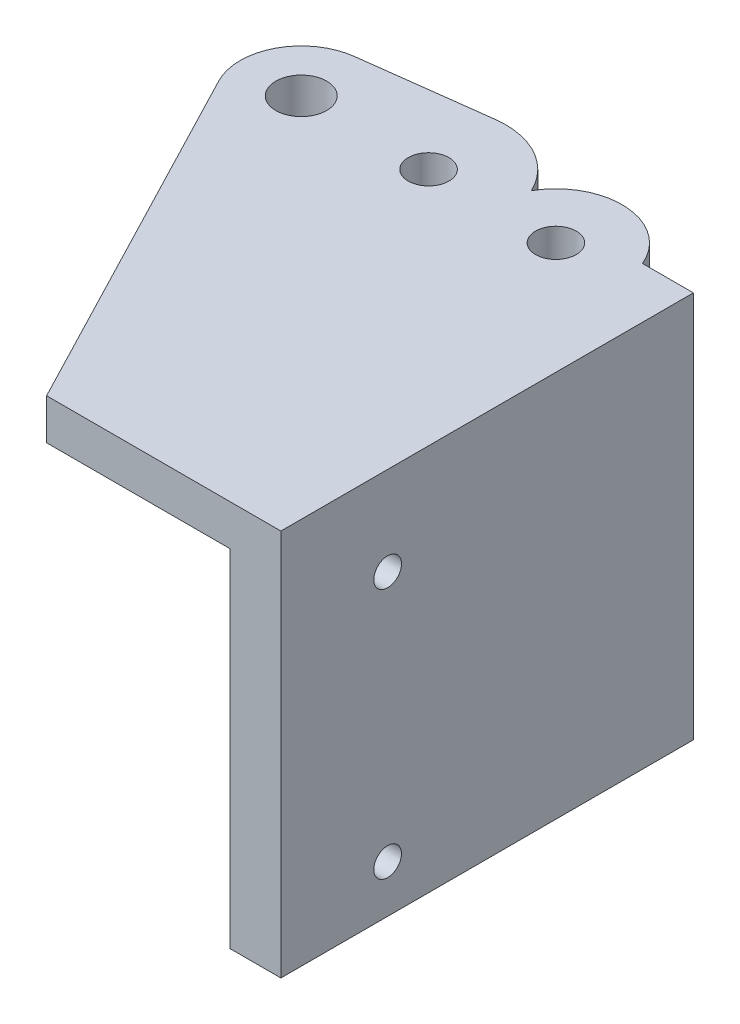
ISO-10303-21;
HEADER;
FILE_DESCRIPTION(('STEP AP214'),'2;1');
FILE_NAME('part.step','',(''),(''),'','','');
FILE_SCHEMA(('AUTOMOTIVE_DESIGN { 1 0 10303 214 1 1 1 1 }'));
ENDSEC;
DATA;
#1=APPLICATION_CONTEXT('core data for automotive mechanical design processes');
#2=APPLICATION_PROTOCOL_DEFINITION('international standard','automotive_design',2000,#1);
#3=PRODUCT_CONTEXT('',#1,'mechanical');
#4=PRODUCT('Part','Part','',(#3));
#5=PRODUCT_RELATED_PRODUCT_CATEGORY('part','',(#4));
#6=PRODUCT_DEFINITION_FORMATION('','',#4);
#7=PRODUCT_DEFINITION_CONTEXT('part definition',#1,'design');
#8=PRODUCT_DEFINITION('design','',#6,#7);
#9=PRODUCT_DEFINITION_SHAPE('','',#8);
#10=(LENGTH_UNIT() NAMED_UNIT(*) SI_UNIT(.MILLI.,.METRE.));
#11=(NAMED_UNIT(*) PLANE_ANGLE_UNIT() SI_UNIT($,.RADIAN.));
#12=(NAMED_UNIT(*) SI_UNIT($,.STERADIAN.) SOLID_ANGLE_UNIT());
#13=UNCERTAINTY_MEASURE_WITH_UNIT(LENGTH_MEASURE(1.E-05),#10,'distance_accuracy_value','');
#14=(GEOMETRIC_REPRESENTATION_CONTEXT(3) GLOBAL_UNCERTAINTY_ASSIGNED_CONTEXT((#13)) GLOBAL_UNIT_ASSIGNED_CONTEXT((#10,
#11,#12)) REPRESENTATION_CONTEXT('',''));
#15=CARTESIAN_POINT('',(0.,0.,0.));
#16=DIRECTION('',(0.,0.,1.));
#17=DIRECTION('',(1.,0.,0.));
#18=AXIS2_PLACEMENT_3D('',#15,#16,#17);
#19=CARTESIAN_POINT('',(0.,-3.175,0.));
#20=DIRECTION('',(0.,1.,0.));
#21=DIRECTION('',(0.,0.,1.));
#22=AXIS2_PLACEMENT_3D('',#19,#20,#21);
#23=PLANE('',#22);
#24=DIRECTION('',(0.,0.,-1.));
#25=VECTOR('',#24,1.);
#26=CARTESIAN_POINT('',(24.60625,-3.175,-7.9375));
#27=LINE('',#26,#25);
#28=CARTESIAN_POINT('',(24.60625,-3.175,30.1625));
#29=VERTEX_POINT('',#28);
#30=CARTESIAN_POINT('',(24.60625,-3.175,1.9813242485078));
#31=VERTEX_POINT('',#30);
#32=EDGE_CURVE('E566',#29,#31,#27,.T.);
#33=ORIENTED_EDGE('',*,*,#32,.F.);
#34=DIRECTION('',(1.,0.,0.));
#35=VECTOR('',#34,1.);
#36=CARTESIAN_POINT('',(28.575,-3.175,30.1625));
#37=LINE('',#36,#35);
#38=CARTESIAN_POINT('',(10.31875,-3.175,30.1625));
#39=VERTEX_POINT('',#38);
#40=EDGE_CURVE('E496',#39,#29,#37,.T.);
#41=ORIENTED_EDGE('',*,*,#40,.F.);
#42=DIRECTION('',(0.461406677584181,0.,0.887188749861453));
#43=VECTOR('',#42,1.);
#44=CARTESIAN_POINT('',(-4.22523642121517,-3.175,2.19744930199466));
#45=LINE('',#44,#43);
#46=CARTESIAN_POINT('',(-4.22523642121517,-3.175,2.19744930199467));
#47=VERTEX_POINT('',#46);
#48=EDGE_CURVE('E507',#47,#39,#45,.T.);
#49=ORIENTED_EDGE('',*,*,#48,.F.);
#50=CARTESIAN_POINT('',(0.,-3.175,0.));
#51=DIRECTION('',(0.,-1.,0.));
#52=DIRECTION('',(0.,0.,-1.));
#53=AXIS2_PLACEMENT_3D('',#50,#51,#52);
#54=CIRCLE('',#53,4.7625);
#55=CARTESIAN_POINT('',(4.27912458099054,-3.175,2.09057386149414));
#56=VERTEX_POINT('',#55);
#57=EDGE_CURVE('E502',#56,#47,#54,.T.);
#58=ORIENTED_EDGE('',*,*,#57,.F.);
#59=CARTESIAN_POINT('',(9.92124,-3.175,0.));
#60=DIRECTION('',(0.,-1.,0.));
#61=DIRECTION('',(0.,0.,-1.));
#62=AXIS2_PLACEMENT_3D('',#59,#60,#61);
#63=CIRCLE('',#62,6.01697311542829);
#64=CARTESIAN_POINT('',(15.3649052181966,-3.175,2.5632936749392));
#65=VERTEX_POINT('',#64);
#66=EDGE_CURVE('E583',#65,#56,#63,.T.);
#67=ORIENTED_EDGE('',*,*,#66,.F.);
#68=CARTESIAN_POINT('',(19.84248,-3.175,0.));
#69=DIRECTION('',(0.,1.,0.));
#70=DIRECTION('',(0.,0.,1.));
#71=AXIS2_PLACEMENT_3D('',#68,#69,#70);
#72=CIRCLE('',#71,5.159375);
#73=EDGE_CURVE('E531',#31,#65,#72,.F.);
#74=ORIENTED_EDGE('',*,*,#73,.F.);
#75=EDGE_LOOP('',(#33,#41,#49,#58,#67,#74));
#76=FACE_BOUND('',#75,.T.);
#77=ADVANCED_FACE('F360',(#76),#23,.F.);
#78=CARTESIAN_POINT('',(19.84248,-6.223,0.));
#79=DIRECTION('',(0.,-1.,0.));
#80=DIRECTION('',(0.,0.,-1.));
#81=AXIS2_PLACEMENT_3D('',#78,#79,#80);
#82=PLANE('',#81);
#83=CARTESIAN_POINT('',(19.84248,-6.223,0.));
#84=DIRECTION('',(0.,-1.,0.));
#85=DIRECTION('',(0.,0.,-1.));
#86=AXIS2_PLACEMENT_3D('',#83,#84,#85);
#87=CIRCLE('',#86,1.5875);
#88=CARTESIAN_POINT('',(19.84248,-6.223,-1.5875));
#89=VERTEX_POINT('',#88);
#90=EDGE_CURVE('E592',#89,#89,#87,.T.);
#91=ORIENTED_EDGE('',*,*,#90,.F.);
#92=EDGE_LOOP('',(#91));
#93=FACE_BOUND('',#92,.T.);
#94=CARTESIAN_POINT('',(19.84248,-6.223,0.));
#95=DIRECTION('',(0.,-1.,0.));
#96=DIRECTION('',(0.,0.,-1.));
#97=AXIS2_PLACEMENT_3D('',#94,#95,#96);
#98=CIRCLE('',#97,5.159375);
#99=CARTESIAN_POINT('',(15.3649052181966,-6.223,-2.5632936749392));
#100=VERTEX_POINT('',#99);
#101=CARTESIAN_POINT('',(24.60625,-6.22300000000001,-1.9813242485078));
#102=VERTEX_POINT('',#101);
#103=EDGE_CURVE('E596',#100,#102,#98,.T.);
#104=ORIENTED_EDGE('',*,*,#103,.T.);
#105=DIRECTION('',(0.,0.,1.));
#106=VECTOR('',#105,1.);
#107=CARTESIAN_POINT('',(24.60625,-6.223,0.));
#108=LINE('',#107,#106);
#109=CARTESIAN_POINT('',(24.60625,-6.223,1.98132424850781));
#110=VERTEX_POINT('',#109);
#111=EDGE_CURVE('E573',#102,#110,#108,.T.);
#112=ORIENTED_EDGE('',*,*,#111,.T.);
#113=CARTESIAN_POINT('',(15.3649052181966,-6.223,2.5632936749392));
#114=VERTEX_POINT('',#113);
#115=EDGE_CURVE('E595',#110,#114,#98,.T.);
#116=ORIENTED_EDGE('',*,*,#115,.T.);
#117=CARTESIAN_POINT('',(9.92124,-6.223,0.));
#118=DIRECTION('',(0.,-1.,0.));
#119=DIRECTION('',(0.,0.,-1.));
#120=AXIS2_PLACEMENT_3D('',#117,#118,#119);
#121=CIRCLE('',#120,6.01697311542829);
#122=EDGE_CURVE('E584',#114,#100,#121,.F.);
#123=ORIENTED_EDGE('',*,*,#122,.T.);
#124=EDGE_LOOP('',(#104,#112,#116,#123));
#125=FACE_BOUND('',#124,.T.);
#126=ADVANCED_FACE('F630',(#93,#125),#82,.T.);
#127=CARTESIAN_POINT('',(19.84248,-6.223,0.));
#128=DIRECTION('',(0.,1.,0.));
#129=DIRECTION('',(0.,0.,1.));
#130=AXIS2_PLACEMENT_3D('',#127,#128,#129);
#131=CYLINDRICAL_SURFACE('',#130,5.159375);
#132=DIRECTION('',(0.,1.,0.));
#133=VECTOR('',#132,1.);
#134=CARTESIAN_POINT('',(24.60625,-6.223,-1.98132424850781));
#135=LINE('',#134,#133);
#136=CARTESIAN_POINT('',(24.60625,0.,-1.9813242485078));
#137=VERTEX_POINT('',#136);
#138=EDGE_CURVE('E460',#102,#137,#135,.T.);
#139=ORIENTED_EDGE('',*,*,#138,.F.);
#140=ORIENTED_EDGE('',*,*,#103,.F.);
#141=DIRECTION('',(0.,1.,0.));
#142=VECTOR('',#141,1.);
#143=CARTESIAN_POINT('',(15.3649052181966,-9.144,-2.5632936749392));
#144=LINE('',#143,#142);
#145=CARTESIAN_POINT('',(15.3649052181966,0.,-2.5632936749392));
#146=VERTEX_POINT('',#145);
#147=EDGE_CURVE('E525',#146,#100,#144,.F.);
#148=ORIENTED_EDGE('',*,*,#147,.F.);
#149=CARTESIAN_POINT('',(19.84248,0.,0.));
#150=DIRECTION('',(0.,1.,0.));
#151=DIRECTION('',(0.,0.,1.));
#152=AXIS2_PLACEMENT_3D('',#149,#150,#151);
#153=CIRCLE('',#152,5.159375);
#154=EDGE_CURVE('E812',#137,#146,#153,.T.);
#155=ORIENTED_EDGE('',*,*,#154,.F.);
#156=EDGE_LOOP('',(#139,#140,#148,#155));
#157=FACE_BOUND('',#156,.T.);
#158=ADVANCED_FACE('F637',(#157),#131,.T.);
#159=DIRECTION('',(0.,1.,0.));
#160=VECTOR('',#159,1.);
#161=CARTESIAN_POINT('',(24.60625,-6.223,1.98132424850781));
#162=LINE('',#161,#160);
#163=EDGE_CURVE('E571',#31,#110,#162,.F.);
#164=ORIENTED_EDGE('',*,*,#163,.F.);
#165=ORIENTED_EDGE('',*,*,#73,.T.);
#166=DIRECTION('',(0.,1.,0.));
#167=VECTOR('',#166,1.);
#168=CARTESIAN_POINT('',(15.3649052181966,-9.144,2.5632936749392));
#169=LINE('',#168,#167);
#170=EDGE_CURVE('E521',#114,#65,#169,.T.);
#171=ORIENTED_EDGE('',*,*,#170,.F.);
#172=ORIENTED_EDGE('',*,*,#115,.F.);
#173=EDGE_LOOP('',(#164,#165,#171,#172));
#174=FACE_BOUND('',#173,.T.);
#175=ADVANCED_FACE('F643',(#174),#131,.T.);
#176=CARTESIAN_POINT('',(4.27912458099054,-3.175,-2.09057386149414));
#177=VERTEX_POINT('',#176);
#178=CARTESIAN_POINT('',(9.16043479726732,-3.175,-5.96867999772828));
#179=VERTEX_POINT('',#178);
#180=EDGE_CURVE('E580',#177,#179,#63,.T.);
#181=ORIENTED_EDGE('',*,*,#180,.F.);
#182=CARTESIAN_POINT('',(-0.602185635286236,-3.175,-4.72427546938733));
#183=VERTEX_POINT('',#182);
#184=EDGE_CURVE('E513',#183,#177,#54,.T.);
#185=ORIENTED_EDGE('',*,*,#184,.F.);
#186=DIRECTION('',(-0.99197385183986,0.,0.126443178012858));
#187=VECTOR('',#186,1.);
#188=CARTESIAN_POINT('',(-0.602185635286236,-3.175,-4.72427546938733));
#189=LINE('',#188,#187);
#190=EDGE_CURVE('E499',#179,#183,#189,.T.);
#191=ORIENTED_EDGE('',*,*,#190,.F.);
#192=EDGE_LOOP('',(#181,#185,#191));
#193=FACE_BOUND('',#192,.T.);
#194=ADVANCED_FACE('F632',(#193),#23,.F.);
#195=CARTESIAN_POINT('',(0.,-3.175,0.));
#196=DIRECTION('',(0.,1.,0.));
#197=DIRECTION('',(0.,0.,1.));
#198=AXIS2_PLACEMENT_3D('',#195,#196,#197);
#199=CYLINDRICAL_SURFACE('',#198,4.7625);
#200=ORIENTED_EDGE('',*,*,#184,.T.);
#201=DIRECTION('',(0.,1.,0.));
#202=VECTOR('',#201,1.);
#203=CARTESIAN_POINT('',(4.27912458099054,-9.144,-2.09057386149414));
#204=LINE('',#203,#202);
#205=CARTESIAN_POINT('',(4.27912458099054,-6.223,-2.09057386149415));
#206=VERTEX_POINT('',#205);
#207=EDGE_CURVE('E590',#177,#206,#204,.F.);
#208=ORIENTED_EDGE('',*,*,#207,.T.);
#209=CARTESIAN_POINT('',(0.,-6.223,0.));
#210=DIRECTION('',(0.,-1.,0.));
#211=DIRECTION('',(0.,0.,-1.));
#212=AXIS2_PLACEMENT_3D('',#209,#210,#211);
#213=CIRCLE('',#212,4.7625);
#214=CARTESIAN_POINT('',(4.27912458099054,-6.223,2.09057386149415));
#215=VERTEX_POINT('',#214);
#216=EDGE_CURVE('E602',#215,#206,#213,.T.);
#217=ORIENTED_EDGE('',*,*,#216,.F.);
#218=DIRECTION('',(0.,1.,0.));
#219=VECTOR('',#218,1.);
#220=CARTESIAN_POINT('',(4.27912458099054,-9.144,2.09057386149414));
#221=LINE('',#220,#219);
#222=EDGE_CURVE('E383',#215,#56,#221,.T.);
#223=ORIENTED_EDGE('',*,*,#222,.T.);
#224=ORIENTED_EDGE('',*,*,#57,.T.);
#225=DIRECTION('',(0.,1.,0.));
#226=VECTOR('',#225,1.);
#227=CARTESIAN_POINT('',(-4.22523642121517,-3.175,2.19744930199466));
#228=LINE('',#227,#226);
#229=CARTESIAN_POINT('',(-4.22523642121517,0.,2.19744930199466));
#230=VERTEX_POINT('',#229);
#231=EDGE_CURVE('E503',#47,#230,#228,.T.);
#232=ORIENTED_EDGE('',*,*,#231,.T.);
#233=CARTESIAN_POINT('',(0.,0.,0.));
#234=DIRECTION('',(0.,1.,0.));
#235=DIRECTION('',(0.,0.,1.));
#236=AXIS2_PLACEMENT_3D('',#233,#234,#235);
#237=CIRCLE('',#236,4.7625);
#238=CARTESIAN_POINT('',(-0.602185635286236,0.,-4.72427546938733));
#239=VERTEX_POINT('',#238);
#240=EDGE_CURVE('E486',#239,#230,#237,.T.);
#241=ORIENTED_EDGE('',*,*,#240,.F.);
#242=DIRECTION('',(0.,1.,0.));
#243=VECTOR('',#242,1.);
#244=CARTESIAN_POINT('',(-0.602185635286236,-3.175,-4.72427546938733));
#245=LINE('',#244,#243);
#246=EDGE_CURVE('E506',#183,#239,#245,.T.);
#247=ORIENTED_EDGE('',*,*,#246,.F.);
#248=EDGE_LOOP('',(#200,#208,#217,#223,#224,#232,#241,#247));
#249=FACE_BOUND('',#248,.T.);
#250=ADVANCED_FACE('F547',(#249),#199,.T.);
#251=CARTESIAN_POINT('',(0.,-6.223,0.));
#252=DIRECTION('',(0.,-1.,0.));
#253=DIRECTION('',(0.,0.,-1.));
#254=AXIS2_PLACEMENT_3D('',#251,#252,#253);
#255=PLANE('',#254);
#256=CARTESIAN_POINT('',(0.,-6.223,0.));
#257=DIRECTION('',(0.,-1.,0.));
#258=DIRECTION('',(0.,0.,-1.));
#259=AXIS2_PLACEMENT_3D('',#256,#257,#258);
#260=CIRCLE('',#259,1.984375);
#261=CARTESIAN_POINT('',(0.,-6.223,-1.984375));
#262=VERTEX_POINT('',#261);
#263=EDGE_CURVE('E599',#262,#262,#260,.T.);
#264=ORIENTED_EDGE('',*,*,#263,.F.);
#265=EDGE_LOOP('',(#264));
#266=FACE_BOUND('',#265,.T.);
#267=ORIENTED_EDGE('',*,*,#216,.T.);
#268=CARTESIAN_POINT('',(9.92124,-6.223,0.));
#269=DIRECTION('',(0.,-1.,0.));
#270=DIRECTION('',(0.,0.,-1.));
#271=AXIS2_PLACEMENT_3D('',#268,#269,#270);
#272=CIRCLE('',#271,6.01697311542829);
#273=EDGE_CURVE('E587',#206,#215,#272,.F.);
#274=ORIENTED_EDGE('',*,*,#273,.T.);
#275=EDGE_LOOP('',(#267,#274));
#276=FACE_BOUND('',#275,.T.);
#277=ADVANCED_FACE('F650',(#266,#276),#255,.T.);
#278=CARTESIAN_POINT('',(28.575,-3.175,30.1625));
#279=DIRECTION('',(0.,0.,1.));
#280=DIRECTION('',(1.,0.,0.));
#281=AXIS2_PLACEMENT_3D('',#278,#279,#280);
#282=PLANE('',#281);
#283=DIRECTION('',(1.,0.,0.));
#284=VECTOR('',#283,1.);
#285=CARTESIAN_POINT('',(28.575,0.,30.1625));
#286=LINE('',#285,#284);
#287=CARTESIAN_POINT('',(10.31875,0.,30.1625));
#288=VERTEX_POINT('',#287);
#289=CARTESIAN_POINT('',(28.575,0.,30.1625));
#290=VERTEX_POINT('',#289);
#291=EDGE_CURVE('E483',#288,#290,#286,.T.);
#292=ORIENTED_EDGE('',*,*,#291,.F.);
#293=DIRECTION('',(0.,1.,0.));
#294=VECTOR('',#293,1.);
#295=CARTESIAN_POINT('',(10.31875,-3.175,30.1625));
#296=LINE('',#295,#294);
#297=EDGE_CURVE('E500',#39,#288,#296,.T.);
#298=ORIENTED_EDGE('',*,*,#297,.F.);
#299=ORIENTED_EDGE('',*,*,#40,.T.);
#300=DIRECTION('',(0.,1.,0.));
#301=VECTOR('',#300,1.);
#302=CARTESIAN_POINT('',(24.60625,-30.1625,30.1625));
#303=LINE('',#302,#301);
#304=CARTESIAN_POINT('',(24.60625,-30.1625,30.1625));
#305=VERTEX_POINT('',#304);
#306=EDGE_CURVE('E559',#305,#29,#303,.T.);
#307=ORIENTED_EDGE('',*,*,#306,.F.);
#308=DIRECTION('',(-1.,0.,0.));
#309=VECTOR('',#308,1.);
#310=CARTESIAN_POINT('',(24.60625,-30.1625,30.1625));
#311=LINE('',#310,#309);
#312=CARTESIAN_POINT('',(28.575,-30.1625,30.1625));
#313=VERTEX_POINT('',#312);
#314=EDGE_CURVE('E558',#313,#305,#311,.T.);
#315=ORIENTED_EDGE('',*,*,#314,.F.);
#316=DIRECTION('',(0.,1.,0.));
#317=VECTOR('',#316,1.);
#318=CARTESIAN_POINT('',(28.575,-3.175,30.1625));
#319=LINE('',#318,#317);
#320=EDGE_CURVE('E504',#313,#290,#319,.T.);
#321=ORIENTED_EDGE('',*,*,#320,.T.);
#322=EDGE_LOOP('',(#292,#298,#299,#307,#315,#321));
#323=FACE_BOUND('',#322,.T.);
#324=ADVANCED_FACE('F362',(#323),#282,.T.);
#325=CARTESIAN_POINT('',(-4.22523642121517,-3.175,2.19744930199466));
#326=DIRECTION('',(-0.887188749861453,0.,0.461406677584181));
#327=DIRECTION('',(0.461406677584181,0.,0.887188749861453));
#328=AXIS2_PLACEMENT_3D('',#325,#326,#327);
#329=PLANE('',#328);
#330=DIRECTION('',(0.461406677584181,0.,0.887188749861453));
#331=VECTOR('',#330,1.);
#332=CARTESIAN_POINT('',(-4.22523642121517,0.,2.19744930199466));
#333=LINE('',#332,#331);
#334=EDGE_CURVE('E494',#230,#288,#333,.T.);
#335=ORIENTED_EDGE('',*,*,#334,.F.);
#336=ORIENTED_EDGE('',*,*,#231,.F.);
#337=ORIENTED_EDGE('',*,*,#48,.T.);
#338=ORIENTED_EDGE('',*,*,#297,.T.);
#339=EDGE_LOOP('',(#335,#336,#337,#338));
#340=FACE_BOUND('',#339,.T.);
#341=ADVANCED_FACE('F553',(#340),#329,.T.);
#342=CARTESIAN_POINT('',(-0.602185635286236,-3.175,-4.72427546938733));
#343=DIRECTION('',(-0.126443178012858,0.,-0.99197385183986));
#344=DIRECTION('',(-0.99197385183986,0.,0.126443178012858));
#345=AXIS2_PLACEMENT_3D('',#342,#343,#344);
#346=PLANE('',#345);
#347=DIRECTION('',(0.,-1.,0.));
#348=VECTOR('',#347,1.);
#349=CARTESIAN_POINT('',(9.16043479726732,0.00102499999999998,-5.96867999772828));
#350=LINE('',#349,#348);
#351=CARTESIAN_POINT('',(9.16043479726732,0.,-5.96867999772828));
#352=VERTEX_POINT('',#351);
#353=EDGE_CURVE('E810',#352,#179,#350,.T.);
#354=ORIENTED_EDGE('',*,*,#353,.T.);
#355=ORIENTED_EDGE('',*,*,#190,.T.);
#356=ORIENTED_EDGE('',*,*,#246,.T.);
#357=DIRECTION('',(-0.99197385183986,0.,0.126443178012858));
#358=VECTOR('',#357,1.);
#359=CARTESIAN_POINT('',(-0.602185635286236,0.,-4.72427546938733));
#360=LINE('',#359,#358);
#361=EDGE_CURVE('E484',#352,#239,#360,.T.);
#362=ORIENTED_EDGE('',*,*,#361,.F.);
#363=EDGE_LOOP('',(#354,#355,#356,#362));
#364=FACE_BOUND('',#363,.T.);
#365=ADVANCED_FACE('F626',(#364),#346,.T.);
#366=CARTESIAN_POINT('',(28.575,-3.175,-7.9375));
#367=DIRECTION('',(1.,0.,0.));
#368=DIRECTION('',(0.,0.,-1.));
#369=AXIS2_PLACEMENT_3D('',#366,#367,#368);
#370=PLANE('',#369);
#371=CARTESIAN_POINT('',(28.575,-26.4668,21.8438757514922));
#372=DIRECTION('',(1.,0.,0.));
#373=DIRECTION('',(0.,0.,-1.));
#374=AXIS2_PLACEMENT_3D('',#371,#372,#373);
#375=CIRCLE('',#374,1.0795);
#376=CARTESIAN_POINT('',(28.575,-26.4668,20.7643757514922));
#377=VERTEX_POINT('',#376);
#378=EDGE_CURVE('E795',#377,#377,#375,.F.);
#379=ORIENTED_EDGE('',*,*,#378,.T.);
#380=EDGE_LOOP('',(#379));
#381=FACE_BOUND('',#380,.T.);
#382=CARTESIAN_POINT('',(28.575,-6.9088,21.8438757514922));
#383=DIRECTION('',(1.,0.,0.));
#384=DIRECTION('',(0.,0.,-1.));
#385=AXIS2_PLACEMENT_3D('',#382,#383,#384);
#386=CIRCLE('',#385,1.0795);
#387=CARTESIAN_POINT('',(28.575,-6.9088,20.7643757514922));
#388=VERTEX_POINT('',#387);
#389=EDGE_CURVE('E799',#388,#388,#386,.F.);
#390=ORIENTED_EDGE('',*,*,#389,.T.);
#391=EDGE_LOOP('',(#390));
#392=FACE_BOUND('',#391,.T.);
#393=DIRECTION('',(0.,1.,0.));
#394=VECTOR('',#393,1.);
#395=CARTESIAN_POINT('',(28.575,-30.1625,-1.98132424850779));
#396=LINE('',#395,#394);
#397=CARTESIAN_POINT('',(28.575,-30.1625,-1.98132424850776));
#398=VERTEX_POINT('',#397);
#399=CARTESIAN_POINT('',(28.575,0.,-1.9813242485078));
#400=VERTEX_POINT('',#399);
#401=EDGE_CURVE('E375',#398,#400,#396,.T.);
#402=ORIENTED_EDGE('',*,*,#401,.T.);
#403=DIRECTION('',(0.,0.,-1.));
#404=VECTOR('',#403,1.);
#405=CARTESIAN_POINT('',(28.575,0.,-7.9375));
#406=LINE('',#405,#404);
#407=EDGE_CURVE('E473',#290,#400,#406,.T.);
#408=ORIENTED_EDGE('',*,*,#407,.F.);
#409=ORIENTED_EDGE('',*,*,#320,.F.);
#410=DIRECTION('',(0.,0.,1.));
#411=VECTOR('',#410,1.);
#412=CARTESIAN_POINT('',(28.575,-30.1625,30.1625));
#413=LINE('',#412,#411);
#414=EDGE_CURVE('E475',#398,#313,#413,.T.);
#415=ORIENTED_EDGE('',*,*,#414,.F.);
#416=EDGE_LOOP('',(#402,#408,#409,#415));
#417=FACE_BOUND('',#416,.T.);
#418=ADVANCED_FACE('F471',(#381,#392,#417),#370,.T.);
#419=CARTESIAN_POINT('',(0.,0.,0.));
#420=DIRECTION('',(0.,1.,0.));
#421=DIRECTION('',(0.,0.,1.));
#422=AXIS2_PLACEMENT_3D('',#419,#420,#421);
#423=PLANE('',#422);
#424=DIRECTION('',(-1.,0.,0.));
#425=VECTOR('',#424,1.);
#426=CARTESIAN_POINT('',(28.576,0.,-1.9813242485078));
#427=LINE('',#426,#425);
#428=EDGE_CURVE('E457',#400,#137,#427,.T.);
#429=ORIENTED_EDGE('',*,*,#428,.T.);
#430=ORIENTED_EDGE('',*,*,#154,.T.);
#431=CARTESIAN_POINT('',(9.92124,0.,0.));
#432=DIRECTION('',(0.,1.,0.));
#433=DIRECTION('',(0.,0.,1.));
#434=AXIS2_PLACEMENT_3D('',#431,#432,#433);
#435=CIRCLE('',#434,6.01697311542829);
#436=EDGE_CURVE('E465',#146,#352,#435,.T.);
#437=ORIENTED_EDGE('',*,*,#436,.T.);
#438=ORIENTED_EDGE('',*,*,#361,.T.);
#439=ORIENTED_EDGE('',*,*,#240,.T.);
#440=ORIENTED_EDGE('',*,*,#334,.T.);
#441=ORIENTED_EDGE('',*,*,#291,.T.);
#442=ORIENTED_EDGE('',*,*,#407,.T.);
#443=EDGE_LOOP('',(#429,#430,#437,#438,#439,#440,#441,#442));
#444=FACE_BOUND('',#443,.T.);
#445=CARTESIAN_POINT('',(19.84248,0.,0.));
#446=DIRECTION('',(0.,1.,0.));
#447=DIRECTION('',(0.,0.,1.));
#448=AXIS2_PLACEMENT_3D('',#445,#446,#447);
#449=CIRCLE('',#448,1.5875);
#450=CARTESIAN_POINT('',(19.84248,0.,1.5875));
#451=VERTEX_POINT('',#450);
#452=EDGE_CURVE('E605',#451,#451,#449,.T.);
#453=ORIENTED_EDGE('',*,*,#452,.F.);
#454=EDGE_LOOP('',(#453));
#455=FACE_BOUND('',#454,.T.);
#456=CARTESIAN_POINT('',(0.,0.,0.));
#457=DIRECTION('',(0.,1.,0.));
#458=DIRECTION('',(0.,0.,1.));
#459=AXIS2_PLACEMENT_3D('',#456,#457,#458);
#460=CIRCLE('',#459,1.984375);
#461=CARTESIAN_POINT('',(0.,0.,1.984375));
#462=VERTEX_POINT('',#461);
#463=EDGE_CURVE('E608',#462,#462,#460,.T.);
#464=ORIENTED_EDGE('',*,*,#463,.F.);
#465=EDGE_LOOP('',(#464));
#466=FACE_BOUND('',#465,.T.);
#467=CARTESIAN_POINT('',(9.92124,0.,0.));
#468=DIRECTION('',(0.,1.,0.));
#469=DIRECTION('',(0.,0.,1.));
#470=AXIS2_PLACEMENT_3D('',#467,#468,#469);
#471=CIRCLE('',#470,1.58750000000001);
#472=CARTESIAN_POINT('',(9.92124,0.,1.58750000000001));
#473=VERTEX_POINT('',#472);
#474=EDGE_CURVE('E488',#473,#473,#471,.T.);
#475=ORIENTED_EDGE('',*,*,#474,.F.);
#476=EDGE_LOOP('',(#475));
#477=FACE_BOUND('',#476,.T.);
#478=ADVANCED_FACE('F479',(#444,#455,#466,#477),#423,.T.);
#479=CARTESIAN_POINT('',(9.92124,-3.175,0.));
#480=DIRECTION('',(0.,1.,0.));
#481=DIRECTION('',(0.,0.,1.));
#482=AXIS2_PLACEMENT_3D('',#479,#480,#481);
#483=CYLINDRICAL_SURFACE('',#482,1.58750000000001);
#484=ORIENTED_EDGE('',*,*,#474,.T.);
#485=EDGE_LOOP('',(#484));
#486=FACE_BOUND('',#485,.T.);
#487=CARTESIAN_POINT('',(9.92124,-15.113,0.));
#488=DIRECTION('',(0.,-1.,0.));
#489=DIRECTION('',(0.,0.,-1.));
#490=AXIS2_PLACEMENT_3D('',#487,#488,#489);
#491=CIRCLE('',#490,1.58750000000001);
#492=CARTESIAN_POINT('',(9.92124,-15.113,-1.58750000000001));
#493=VERTEX_POINT('',#492);
#494=EDGE_CURVE('E577',#493,#493,#491,.T.);
#495=ORIENTED_EDGE('',*,*,#494,.T.);
#496=EDGE_LOOP('',(#495));
#497=FACE_BOUND('',#496,.T.);
#498=ADVANCED_FACE('F613',(#486,#497),#483,.F.);
#499=CARTESIAN_POINT('',(0.,-3.175,0.));
#500=DIRECTION('',(0.,1.,0.));
#501=DIRECTION('',(0.,0.,1.));
#502=AXIS2_PLACEMENT_3D('',#499,#500,#501);
#503=CYLINDRICAL_SURFACE('',#502,1.984375);
#504=ORIENTED_EDGE('',*,*,#463,.T.);
#505=EDGE_LOOP('',(#504));
#506=FACE_BOUND('',#505,.T.);
#507=ORIENTED_EDGE('',*,*,#263,.T.);
#508=EDGE_LOOP('',(#507));
#509=FACE_BOUND('',#508,.T.);
#510=ADVANCED_FACE('F623',(#506,#509),#503,.F.);
#511=CARTESIAN_POINT('',(19.84248,-3.175,0.));
#512=DIRECTION('',(0.,1.,0.));
#513=DIRECTION('',(0.,0.,1.));
#514=AXIS2_PLACEMENT_3D('',#511,#512,#513);
#515=CYLINDRICAL_SURFACE('',#514,1.5875);
#516=ORIENTED_EDGE('',*,*,#452,.T.);
#517=EDGE_LOOP('',(#516));
#518=FACE_BOUND('',#517,.T.);
#519=ORIENTED_EDGE('',*,*,#90,.T.);
#520=EDGE_LOOP('',(#519));
#521=FACE_BOUND('',#520,.T.);
#522=ADVANCED_FACE('F668',(#518,#521),#515,.F.);
#523=CARTESIAN_POINT('',(9.92124,-15.113,0.));
#524=DIRECTION('',(0.,1.,0.));
#525=DIRECTION('',(0.,0.,1.));
#526=AXIS2_PLACEMENT_3D('',#523,#524,#525);
#527=CYLINDRICAL_SURFACE('',#526,6.01697311542829);
#528=CARTESIAN_POINT('',(9.92124,-8.76299999999995,0.));
#529=DIRECTION('',(0.,-1.,0.));
#530=DIRECTION('',(0.,0.,-1.));
#531=AXIS2_PLACEMENT_3D('',#528,#529,#530);
#532=CIRCLE('',#531,6.01697311542829);
#533=CARTESIAN_POINT('',(9.92124,-8.76299999999995,-6.01697311542829));
#534=VERTEX_POINT('',#533);
#535=EDGE_CURVE('E11',#534,#534,#532,.F.);
#536=ORIENTED_EDGE('',*,*,#535,.T.);
#537=EDGE_LOOP('',(#536));
#538=FACE_BOUND('',#537,.T.);
#539=ORIENTED_EDGE('',*,*,#207,.F.);
#540=ORIENTED_EDGE('',*,*,#180,.T.);
#541=ORIENTED_EDGE('',*,*,#353,.F.);
#542=ORIENTED_EDGE('',*,*,#436,.F.);
#543=ORIENTED_EDGE('',*,*,#147,.T.);
#544=ORIENTED_EDGE('',*,*,#122,.F.);
#545=ORIENTED_EDGE('',*,*,#170,.T.);
#546=ORIENTED_EDGE('',*,*,#66,.T.);
#547=ORIENTED_EDGE('',*,*,#222,.F.);
#548=ORIENTED_EDGE('',*,*,#273,.F.);
#549=EDGE_LOOP('',(#539,#540,#541,#542,#543,#544,#545,#546,#547,#548));
#550=FACE_BOUND('',#549,.T.);
#551=ADVANCED_FACE('F658',(#538,#550),#527,.T.);
#552=CARTESIAN_POINT('',(9.92124,-15.113,0.));
#553=DIRECTION('',(0.,-1.,0.));
#554=DIRECTION('',(0.,0.,-1.));
#555=AXIS2_PLACEMENT_3D('',#552,#553,#554);
#556=PLANE('',#555);
#557=CARTESIAN_POINT('',(9.92124,-15.113,0.));
#558=DIRECTION('',(0.,-1.,0.));
#559=DIRECTION('',(0.,0.,-1.));
#560=AXIS2_PLACEMENT_3D('',#557,#558,#559);
#561=CIRCLE('',#560,2.84197311542828);
#562=CARTESIAN_POINT('',(9.92124,-15.113,-2.84197311542828));
#563=VERTEX_POINT('',#562);
#564=EDGE_CURVE('E368',#563,#563,#561,.T.);
#565=ORIENTED_EDGE('',*,*,#564,.T.);
#566=EDGE_LOOP('',(#565));
#567=FACE_BOUND('',#566,.T.);
#568=ORIENTED_EDGE('',*,*,#494,.F.);
#569=EDGE_LOOP('',(#568));
#570=FACE_BOUND('',#569,.T.);
#571=ADVANCED_FACE('F712',(#567,#570),#556,.T.);
#572=CARTESIAN_POINT('',(24.60625,-30.1625,-7.9375));
#573=DIRECTION('',(1.,0.,0.));
#574=DIRECTION('',(0.,0.,-1.));
#575=AXIS2_PLACEMENT_3D('',#572,#573,#574);
#576=PLANE('',#575);
#577=CARTESIAN_POINT('',(24.60625,-26.4668,21.8438757514922));
#578=DIRECTION('',(-1.,0.,0.));
#579=DIRECTION('',(0.,0.,1.));
#580=AXIS2_PLACEMENT_3D('',#577,#578,#579);
#581=CIRCLE('',#580,1.0795);
#582=CARTESIAN_POINT('',(24.60625,-26.4668,22.9233757514922));
#583=VERTEX_POINT('',#582);
#584=EDGE_CURVE('E798',#583,#583,#581,.T.);
#585=ORIENTED_EDGE('',*,*,#584,.F.);
#586=EDGE_LOOP('',(#585));
#587=FACE_BOUND('',#586,.T.);
#588=CARTESIAN_POINT('',(24.60625,-6.9088,21.8438757514922));
#589=DIRECTION('',(-1.,0.,0.));
#590=DIRECTION('',(0.,0.,1.));
#591=AXIS2_PLACEMENT_3D('',#588,#589,#590);
#592=CIRCLE('',#591,1.0795);
#593=CARTESIAN_POINT('',(24.60625,-6.9088,22.9233757514922));
#594=VERTEX_POINT('',#593);
#595=EDGE_CURVE('E477',#594,#594,#592,.T.);
#596=ORIENTED_EDGE('',*,*,#595,.F.);
#597=EDGE_LOOP('',(#596));
#598=FACE_BOUND('',#597,.T.);
#599=ORIENTED_EDGE('',*,*,#111,.F.);
#600=DIRECTION('',(0.,1.,0.));
#601=VECTOR('',#600,1.);
#602=CARTESIAN_POINT('',(24.60625,-30.1625,-1.98132424850779));
#603=LINE('',#602,#601);
#604=CARTESIAN_POINT('',(24.60625,-30.1625,-1.98132424850779));
#605=VERTEX_POINT('',#604);
#606=EDGE_CURVE('E476',#605,#102,#603,.T.);
#607=ORIENTED_EDGE('',*,*,#606,.F.);
#608=DIRECTION('',(0.,0.,-1.));
#609=VECTOR('',#608,1.);
#610=CARTESIAN_POINT('',(24.60625,-30.1625,-7.9375));
#611=LINE('',#610,#609);
#612=EDGE_CURVE('E563',#305,#605,#611,.T.);
#613=ORIENTED_EDGE('',*,*,#612,.F.);
#614=ORIENTED_EDGE('',*,*,#306,.T.);
#615=ORIENTED_EDGE('',*,*,#32,.T.);
#616=ORIENTED_EDGE('',*,*,#163,.T.);
#617=EDGE_LOOP('',(#599,#607,#613,#614,#615,#616));
#618=FACE_BOUND('',#617,.T.);
#619=ADVANCED_FACE('F723',(#587,#598,#618),#576,.F.);
#620=CARTESIAN_POINT('',(28.575,-30.1625,30.1625));
#621=DIRECTION('',(0.,-1.,0.));
#622=DIRECTION('',(0.,0.,-1.));
#623=AXIS2_PLACEMENT_3D('',#620,#621,#622);
#624=PLANE('',#623);
#625=DIRECTION('',(-1.,0.,0.));
#626=VECTOR('',#625,1.);
#627=CARTESIAN_POINT('',(28.576,-30.1625,-1.98132424850779));
#628=LINE('',#627,#626);
#629=EDGE_CURVE('E466',#398,#605,#628,.T.);
#630=ORIENTED_EDGE('',*,*,#629,.F.);
#631=ORIENTED_EDGE('',*,*,#414,.T.);
#632=ORIENTED_EDGE('',*,*,#314,.T.);
#633=ORIENTED_EDGE('',*,*,#612,.T.);
#634=EDGE_LOOP('',(#630,#631,#632,#633));
#635=FACE_BOUND('',#634,.T.);
#636=ADVANCED_FACE('F763',(#635),#624,.T.);
#637=CARTESIAN_POINT('',(9.92124,-15.113,0.));
#638=DIRECTION('',(0.,1.,0.));
#639=DIRECTION('',(0.,0.,1.));
#640=AXIS2_PLACEMENT_3D('',#637,#638,#639);
#641=CONICAL_SURFACE('',#640,2.84197311542828,0.463647609000804);
#642=ORIENTED_EDGE('',*,*,#535,.F.);
#643=EDGE_LOOP('',(#642));
#644=FACE_BOUND('',#643,.T.);
#645=ORIENTED_EDGE('',*,*,#564,.F.);
#646=EDGE_LOOP('',(#645));
#647=FACE_BOUND('',#646,.T.);
#648=ADVANCED_FACE('F771',(#644,#647),#641,.T.);
#649=CARTESIAN_POINT('',(28.576,-30.1625,-1.98132424850779));
#650=DIRECTION('',(0.,0.,1.));
#651=DIRECTION('',(0.,-1.,0.));
#652=AXIS2_PLACEMENT_3D('',#649,#650,#651);
#653=PLANE('',#652);
#654=ORIENTED_EDGE('',*,*,#629,.T.);
#655=ORIENTED_EDGE('',*,*,#606,.T.);
#656=ORIENTED_EDGE('',*,*,#138,.T.);
#657=ORIENTED_EDGE('',*,*,#428,.F.);
#658=ORIENTED_EDGE('',*,*,#401,.F.);
#659=EDGE_LOOP('',(#654,#655,#656,#657,#658));
#660=FACE_BOUND('',#659,.T.);
#661=ADVANCED_FACE('F458',(#660),#653,.F.);
#662=CARTESIAN_POINT('',(28.576,-6.9088,21.8438757514922));
#663=DIRECTION('',(-1.,0.,0.));
#664=DIRECTION('',(0.,0.,1.));
#665=AXIS2_PLACEMENT_3D('',#662,#663,#664);
#666=CYLINDRICAL_SURFACE('',#665,1.0795);
#667=ORIENTED_EDGE('',*,*,#389,.F.);
#668=EDGE_LOOP('',(#667));
#669=FACE_BOUND('',#668,.T.);
#670=ORIENTED_EDGE('',*,*,#595,.T.);
#671=EDGE_LOOP('',(#670));
#672=FACE_BOUND('',#671,.T.);
#673=ADVANCED_FACE('F779',(#669,#672),#666,.F.);
#674=CARTESIAN_POINT('',(28.576,-26.4668,21.8438757514922));
#675=DIRECTION('',(-1.,0.,0.));
#676=DIRECTION('',(0.,0.,1.));
#677=AXIS2_PLACEMENT_3D('',#674,#675,#676);
#678=CYLINDRICAL_SURFACE('',#677,1.0795);
#679=ORIENTED_EDGE('',*,*,#378,.F.);
#680=EDGE_LOOP('',(#679));
#681=FACE_BOUND('',#680,.T.);
#682=ORIENTED_EDGE('',*,*,#584,.T.);
#683=EDGE_LOOP('',(#682));
#684=FACE_BOUND('',#683,.T.);
#685=ADVANCED_FACE('F786',(#681,#684),#678,.F.);
#686=CLOSED_SHELL('',(#77,#126,#158,#175,#194,#250,#277,#324,#341,#365,#418,#478,#498,#510,#522,
#551,#571,#619,#636,#648,#661,#673,#685));
#687=MANIFOLD_SOLID_BREP('B2',#686);
#688=ADVANCED_BREP_SHAPE_REPRESENTATION('',(#18,#687),#14);
#689=SHAPE_DEFINITION_REPRESENTATION(#9,#688);
ENDSEC;
END-ISO-10303-21;
